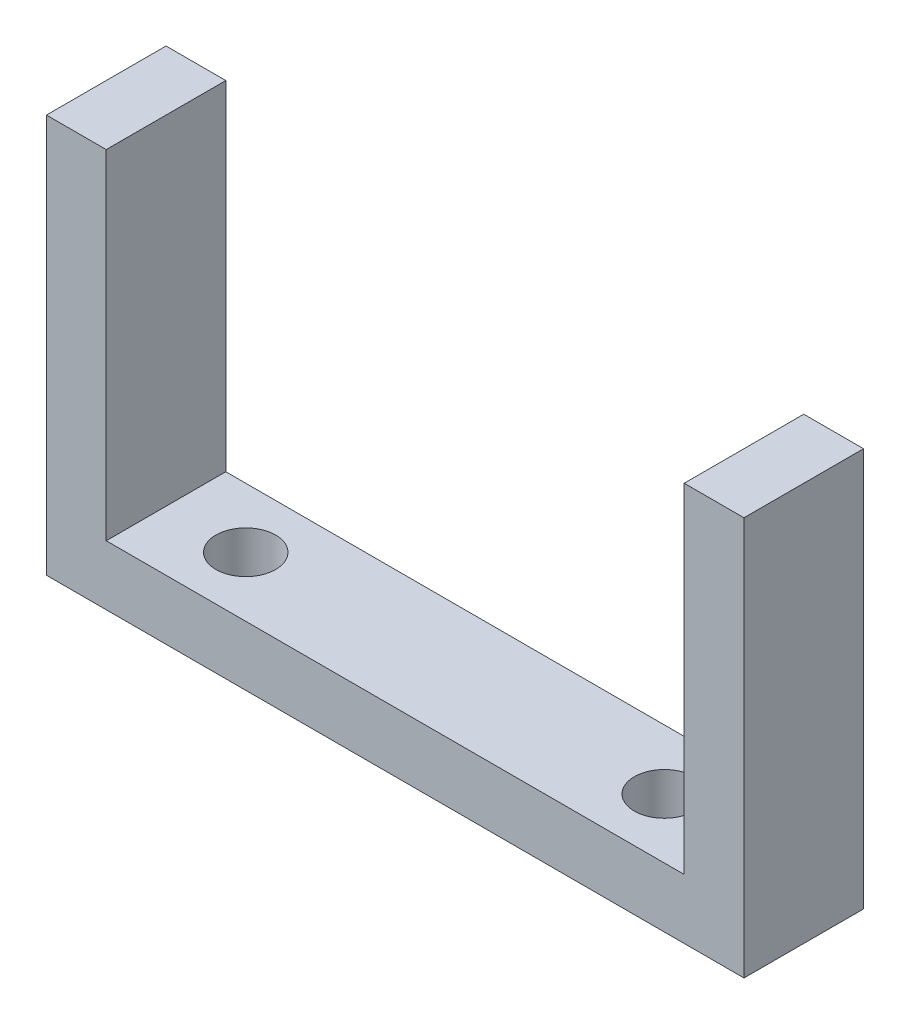
ISO-10303-21;
HEADER;
FILE_DESCRIPTION(('STEP AP214'),'2;1');
FILE_NAME('part.step','',(''),(''),'','','');
FILE_SCHEMA(('AUTOMOTIVE_DESIGN { 1 0 10303 214 1 1 1 1 }'));
ENDSEC;
DATA;
#1=APPLICATION_CONTEXT('core data for automotive mechanical design processes');
#2=APPLICATION_PROTOCOL_DEFINITION('international standard','automotive_design',2000,#1);
#3=PRODUCT_CONTEXT('',#1,'mechanical');
#4=PRODUCT('Part','Part','',(#3));
#5=PRODUCT_RELATED_PRODUCT_CATEGORY('part','',(#4));
#6=PRODUCT_DEFINITION_FORMATION('','',#4);
#7=PRODUCT_DEFINITION_CONTEXT('part definition',#1,'design');
#8=PRODUCT_DEFINITION('design','',#6,#7);
#9=PRODUCT_DEFINITION_SHAPE('','',#8);
#10=(LENGTH_UNIT() NAMED_UNIT(*) SI_UNIT(.MILLI.,.METRE.));
#11=(NAMED_UNIT(*) PLANE_ANGLE_UNIT() SI_UNIT($,.RADIAN.));
#12=(NAMED_UNIT(*) SI_UNIT($,.STERADIAN.) SOLID_ANGLE_UNIT());
#13=UNCERTAINTY_MEASURE_WITH_UNIT(LENGTH_MEASURE(1.E-05),#10,'distance_accuracy_value','');
#14=(GEOMETRIC_REPRESENTATION_CONTEXT(3) GLOBAL_UNCERTAINTY_ASSIGNED_CONTEXT((#13)) GLOBAL_UNIT_ASSIGNED_CONTEXT((#10,
#11,#12)) REPRESENTATION_CONTEXT('',''));
#15=CARTESIAN_POINT('',(0.,0.,0.));
#16=DIRECTION('',(0.,0.,1.));
#17=DIRECTION('',(1.,0.,0.));
#18=AXIS2_PLACEMENT_3D('',#15,#16,#17);
#19=CARTESIAN_POINT('',(0.,0.,6.));
#20=DIRECTION('',(-1.,0.,0.));
#21=DIRECTION('',(0.,-1.,0.));
#22=AXIS2_PLACEMENT_3D('',#19,#20,#21);
#23=PLANE('',#22);
#24=DIRECTION('',(0.,1.,0.));
#25=VECTOR('',#24,1.);
#26=CARTESIAN_POINT('',(0.,0.,0.));
#27=LINE('',#26,#25);
#28=CARTESIAN_POINT('',(0.,-20.,0.));
#29=VERTEX_POINT('',#28);
#30=CARTESIAN_POINT('',(0.,0.,0.));
#31=VERTEX_POINT('',#30);
#32=EDGE_CURVE('E129',#29,#31,#27,.T.);
#33=ORIENTED_EDGE('',*,*,#32,.T.);
#34=DIRECTION('',(0.,0.,-1.));
#35=VECTOR('',#34,1.);
#36=CARTESIAN_POINT('',(0.,0.,6.));
#37=LINE('',#36,#35);
#38=CARTESIAN_POINT('',(0.,0.,6.));
#39=VERTEX_POINT('',#38);
#40=EDGE_CURVE('E11',#39,#31,#37,.T.);
#41=ORIENTED_EDGE('',*,*,#40,.F.);
#42=DIRECTION('',(0.,1.,0.));
#43=VECTOR('',#42,1.);
#44=CARTESIAN_POINT('',(0.,0.,6.));
#45=LINE('',#44,#43);
#46=CARTESIAN_POINT('',(0.,-20.,6.));
#47=VERTEX_POINT('',#46);
#48=EDGE_CURVE('E144',#47,#39,#45,.T.);
#49=ORIENTED_EDGE('',*,*,#48,.F.);
#50=DIRECTION('',(0.,0.,-1.));
#51=VECTOR('',#50,1.);
#52=CARTESIAN_POINT('',(0.,-20.,6.));
#53=LINE('',#52,#51);
#54=EDGE_CURVE('E125',#47,#29,#53,.T.);
#55=ORIENTED_EDGE('',*,*,#54,.T.);
#56=EDGE_LOOP('',(#33,#41,#49,#55));
#57=FACE_BOUND('',#56,.T.);
#58=ADVANCED_FACE('F33',(#57),#23,.F.);
#59=CARTESIAN_POINT('',(0.,0.,6.));
#60=DIRECTION('',(0.,-1.,0.));
#61=DIRECTION('',(0.,0.,-1.));
#62=AXIS2_PLACEMENT_3D('',#59,#60,#61);
#63=PLANE('',#62);
#64=DIRECTION('',(-1.,0.,0.));
#65=VECTOR('',#64,1.);
#66=CARTESIAN_POINT('',(0.,0.,0.));
#67=LINE('',#66,#65);
#68=CARTESIAN_POINT('',(-3.,0.,0.));
#69=VERTEX_POINT('',#68);
#70=EDGE_CURVE('E132',#31,#69,#67,.T.);
#71=ORIENTED_EDGE('',*,*,#70,.T.);
#72=DIRECTION('',(0.,0.,-1.));
#73=VECTOR('',#72,1.);
#74=CARTESIAN_POINT('',(-3.,0.,6.));
#75=LINE('',#74,#73);
#76=CARTESIAN_POINT('',(-3.,0.,6.));
#77=VERTEX_POINT('',#76);
#78=EDGE_CURVE('E41',#77,#69,#75,.T.);
#79=ORIENTED_EDGE('',*,*,#78,.F.);
#80=DIRECTION('',(-1.,0.,0.));
#81=VECTOR('',#80,1.);
#82=CARTESIAN_POINT('',(0.,0.,6.));
#83=LINE('',#82,#81);
#84=EDGE_CURVE('E92',#39,#77,#83,.T.);
#85=ORIENTED_EDGE('',*,*,#84,.F.);
#86=ORIENTED_EDGE('',*,*,#40,.T.);
#87=EDGE_LOOP('',(#71,#79,#85,#86));
#88=FACE_BOUND('',#87,.T.);
#89=ADVANCED_FACE('F214',(#88),#63,.F.);
#90=CARTESIAN_POINT('',(-3.,0.,6.));
#91=DIRECTION('',(1.,0.,0.));
#92=DIRECTION('',(0.,1.,0.));
#93=AXIS2_PLACEMENT_3D('',#90,#91,#92);
#94=PLANE('',#93);
#95=DIRECTION('',(0.,-1.,0.));
#96=VECTOR('',#95,1.);
#97=CARTESIAN_POINT('',(-3.,0.,0.));
#98=LINE('',#97,#96);
#99=CARTESIAN_POINT('',(-3.,-17.,0.));
#100=VERTEX_POINT('',#99);
#101=EDGE_CURVE('E135',#69,#100,#98,.T.);
#102=ORIENTED_EDGE('',*,*,#101,.T.);
#103=DIRECTION('',(0.,0.,-1.));
#104=VECTOR('',#103,1.);
#105=CARTESIAN_POINT('',(-3.,-17.,6.));
#106=LINE('',#105,#104);
#107=CARTESIAN_POINT('',(-3.,-17.,6.));
#108=VERTEX_POINT('',#107);
#109=EDGE_CURVE('E151',#108,#100,#106,.T.);
#110=ORIENTED_EDGE('',*,*,#109,.F.);
#111=DIRECTION('',(0.,-1.,0.));
#112=VECTOR('',#111,1.);
#113=CARTESIAN_POINT('',(-3.,0.,6.));
#114=LINE('',#113,#112);
#115=EDGE_CURVE('E159',#77,#108,#114,.T.);
#116=ORIENTED_EDGE('',*,*,#115,.F.);
#117=ORIENTED_EDGE('',*,*,#78,.T.);
#118=EDGE_LOOP('',(#102,#110,#116,#117));
#119=FACE_BOUND('',#118,.T.);
#120=ADVANCED_FACE('F157',(#119),#94,.F.);
#121=CARTESIAN_POINT('',(-3.,-17.,6.));
#122=DIRECTION('',(0.,-1.,0.));
#123=DIRECTION('',(1.,0.,0.));
#124=AXIS2_PLACEMENT_3D('',#121,#122,#123);
#125=PLANE('',#124);
#126=CARTESIAN_POINT('',(-28.,-17.,3.));
#127=DIRECTION('',(0.,-1.,0.));
#128=DIRECTION('',(0.,0.,-1.));
#129=AXIS2_PLACEMENT_3D('',#126,#127,#128);
#130=CIRCLE('',#129,1.5);
#131=CARTESIAN_POINT('',(-28.,-17.,1.5));
#132=VERTEX_POINT('',#131);
#133=EDGE_CURVE('E133',#132,#132,#130,.T.);
#134=ORIENTED_EDGE('',*,*,#133,.T.);
#135=EDGE_LOOP('',(#134));
#136=FACE_BOUND('',#135,.T.);
#137=CARTESIAN_POINT('',(-7.,-17.,3.));
#138=DIRECTION('',(0.,-1.,0.));
#139=DIRECTION('',(0.,0.,-1.));
#140=AXIS2_PLACEMENT_3D('',#137,#138,#139);
#141=CIRCLE('',#140,1.5);
#142=CARTESIAN_POINT('',(-7.,-17.,1.5));
#143=VERTEX_POINT('',#142);
#144=EDGE_CURVE('E180',#143,#143,#141,.T.);
#145=ORIENTED_EDGE('',*,*,#144,.T.);
#146=EDGE_LOOP('',(#145));
#147=FACE_BOUND('',#146,.T.);
#148=DIRECTION('',(-1.,0.,0.));
#149=VECTOR('',#148,1.);
#150=CARTESIAN_POINT('',(-3.,-17.,0.));
#151=LINE('',#150,#149);
#152=CARTESIAN_POINT('',(-32.,-17.,0.));
#153=VERTEX_POINT('',#152);
#154=EDGE_CURVE('E137',#100,#153,#151,.T.);
#155=ORIENTED_EDGE('',*,*,#154,.T.);
#156=DIRECTION('',(0.,0.,-1.));
#157=VECTOR('',#156,1.);
#158=CARTESIAN_POINT('',(-32.,-17.,6.));
#159=LINE('',#158,#157);
#160=CARTESIAN_POINT('',(-32.,-17.,6.));
#161=VERTEX_POINT('',#160);
#162=EDGE_CURVE('E148',#161,#153,#159,.T.);
#163=ORIENTED_EDGE('',*,*,#162,.F.);
#164=DIRECTION('',(-1.,0.,0.));
#165=VECTOR('',#164,1.);
#166=CARTESIAN_POINT('',(-3.,-17.,6.));
#167=LINE('',#166,#165);
#168=EDGE_CURVE('E171',#108,#161,#167,.T.);
#169=ORIENTED_EDGE('',*,*,#168,.F.);
#170=ORIENTED_EDGE('',*,*,#109,.T.);
#171=EDGE_LOOP('',(#155,#163,#169,#170));
#172=FACE_BOUND('',#171,.T.);
#173=ADVANCED_FACE('F167',(#136,#147,#172),#125,.F.);
#174=CARTESIAN_POINT('',(-32.,0.,6.));
#175=DIRECTION('',(-1.,0.,0.));
#176=DIRECTION('',(0.,0.,1.));
#177=AXIS2_PLACEMENT_3D('',#174,#175,#176);
#178=PLANE('',#177);
#179=DIRECTION('',(0.,1.,0.));
#180=VECTOR('',#179,1.);
#181=CARTESIAN_POINT('',(-32.,0.,0.));
#182=LINE('',#181,#180);
#183=CARTESIAN_POINT('',(-32.,0.,0.));
#184=VERTEX_POINT('',#183);
#185=EDGE_CURVE('E139',#153,#184,#182,.T.);
#186=ORIENTED_EDGE('',*,*,#185,.T.);
#187=DIRECTION('',(0.,0.,-1.));
#188=VECTOR('',#187,1.);
#189=CARTESIAN_POINT('',(-32.,0.,6.));
#190=LINE('',#189,#188);
#191=CARTESIAN_POINT('',(-32.,0.,6.));
#192=VERTEX_POINT('',#191);
#193=EDGE_CURVE('E120',#192,#184,#190,.T.);
#194=ORIENTED_EDGE('',*,*,#193,.F.);
#195=DIRECTION('',(0.,1.,0.));
#196=VECTOR('',#195,1.);
#197=CARTESIAN_POINT('',(-32.,0.,6.));
#198=LINE('',#197,#196);
#199=EDGE_CURVE('E111',#161,#192,#198,.T.);
#200=ORIENTED_EDGE('',*,*,#199,.F.);
#201=ORIENTED_EDGE('',*,*,#162,.T.);
#202=EDGE_LOOP('',(#186,#194,#200,#201));
#203=FACE_BOUND('',#202,.T.);
#204=ADVANCED_FACE('F170',(#203),#178,.F.);
#205=CARTESIAN_POINT('',(-32.,0.,6.));
#206=DIRECTION('',(0.,-1.,0.));
#207=DIRECTION('',(1.,0.,0.));
#208=AXIS2_PLACEMENT_3D('',#205,#206,#207);
#209=PLANE('',#208);
#210=DIRECTION('',(-1.,0.,0.));
#211=VECTOR('',#210,1.);
#212=CARTESIAN_POINT('',(-32.,0.,0.));
#213=LINE('',#212,#211);
#214=CARTESIAN_POINT('',(-35.,0.,0.));
#215=VERTEX_POINT('',#214);
#216=EDGE_CURVE('E119',#184,#215,#213,.T.);
#217=ORIENTED_EDGE('',*,*,#216,.T.);
#218=DIRECTION('',(0.,0.,-1.));
#219=VECTOR('',#218,1.);
#220=CARTESIAN_POINT('',(-35.,0.,6.));
#221=LINE('',#220,#219);
#222=CARTESIAN_POINT('',(-35.,0.,6.));
#223=VERTEX_POINT('',#222);
#224=EDGE_CURVE('E116',#223,#215,#221,.T.);
#225=ORIENTED_EDGE('',*,*,#224,.F.);
#226=DIRECTION('',(-1.,0.,0.));
#227=VECTOR('',#226,1.);
#228=CARTESIAN_POINT('',(-32.,0.,6.));
#229=LINE('',#228,#227);
#230=EDGE_CURVE('E105',#192,#223,#229,.T.);
#231=ORIENTED_EDGE('',*,*,#230,.F.);
#232=ORIENTED_EDGE('',*,*,#193,.T.);
#233=EDGE_LOOP('',(#217,#225,#231,#232));
#234=FACE_BOUND('',#233,.T.);
#235=ADVANCED_FACE('F117',(#234),#209,.F.);
#236=CARTESIAN_POINT('',(-35.,0.,6.));
#237=DIRECTION('',(1.,0.,0.));
#238=DIRECTION('',(0.,1.,0.));
#239=AXIS2_PLACEMENT_3D('',#236,#237,#238);
#240=PLANE('',#239);
#241=DIRECTION('',(0.,-1.,0.));
#242=VECTOR('',#241,1.);
#243=CARTESIAN_POINT('',(-35.,0.,0.));
#244=LINE('',#243,#242);
#245=CARTESIAN_POINT('',(-35.,-20.,0.));
#246=VERTEX_POINT('',#245);
#247=EDGE_CURVE('E78',#215,#246,#244,.T.);
#248=ORIENTED_EDGE('',*,*,#247,.T.);
#249=DIRECTION('',(0.,0.,-1.));
#250=VECTOR('',#249,1.);
#251=CARTESIAN_POINT('',(-35.,-20.,6.));
#252=LINE('',#251,#250);
#253=CARTESIAN_POINT('',(-35.,-20.,6.));
#254=VERTEX_POINT('',#253);
#255=EDGE_CURVE('E121',#254,#246,#252,.T.);
#256=ORIENTED_EDGE('',*,*,#255,.F.);
#257=DIRECTION('',(0.,-1.,0.));
#258=VECTOR('',#257,1.);
#259=CARTESIAN_POINT('',(-35.,0.,6.));
#260=LINE('',#259,#258);
#261=EDGE_CURVE('E109',#223,#254,#260,.T.);
#262=ORIENTED_EDGE('',*,*,#261,.F.);
#263=ORIENTED_EDGE('',*,*,#224,.T.);
#264=EDGE_LOOP('',(#248,#256,#262,#263));
#265=FACE_BOUND('',#264,.T.);
#266=ADVANCED_FACE('F123',(#265),#240,.F.);
#267=CARTESIAN_POINT('',(0.,-20.,6.));
#268=DIRECTION('',(0.,1.,0.));
#269=DIRECTION('',(0.,0.,1.));
#270=AXIS2_PLACEMENT_3D('',#267,#268,#269);
#271=PLANE('',#270);
#272=CARTESIAN_POINT('',(-28.,-20.,3.));
#273=DIRECTION('',(0.,-1.,0.));
#274=DIRECTION('',(0.,0.,-1.));
#275=AXIS2_PLACEMENT_3D('',#272,#273,#274);
#276=CIRCLE('',#275,1.5);
#277=CARTESIAN_POINT('',(-28.,-20.,1.5));
#278=VERTEX_POINT('',#277);
#279=EDGE_CURVE('E183',#278,#278,#276,.T.);
#280=ORIENTED_EDGE('',*,*,#279,.F.);
#281=EDGE_LOOP('',(#280));
#282=FACE_BOUND('',#281,.T.);
#283=CARTESIAN_POINT('',(-7.,-20.,3.));
#284=DIRECTION('',(0.,-1.,0.));
#285=DIRECTION('',(0.,0.,-1.));
#286=AXIS2_PLACEMENT_3D('',#283,#284,#285);
#287=CIRCLE('',#286,1.5);
#288=CARTESIAN_POINT('',(-7.,-20.,1.5));
#289=VERTEX_POINT('',#288);
#290=EDGE_CURVE('E177',#289,#289,#287,.T.);
#291=ORIENTED_EDGE('',*,*,#290,.F.);
#292=EDGE_LOOP('',(#291));
#293=FACE_BOUND('',#292,.T.);
#294=DIRECTION('',(1.,0.,0.));
#295=VECTOR('',#294,1.);
#296=CARTESIAN_POINT('',(0.,-20.,0.));
#297=LINE('',#296,#295);
#298=EDGE_CURVE('E84',#246,#29,#297,.T.);
#299=ORIENTED_EDGE('',*,*,#298,.T.);
#300=ORIENTED_EDGE('',*,*,#54,.F.);
#301=DIRECTION('',(1.,0.,0.));
#302=VECTOR('',#301,1.);
#303=CARTESIAN_POINT('',(0.,-20.,6.));
#304=LINE('',#303,#302);
#305=EDGE_CURVE('E49',#254,#47,#304,.T.);
#306=ORIENTED_EDGE('',*,*,#305,.F.);
#307=ORIENTED_EDGE('',*,*,#255,.T.);
#308=EDGE_LOOP('',(#299,#300,#306,#307));
#309=FACE_BOUND('',#308,.T.);
#310=ADVANCED_FACE('F198',(#282,#293,#309),#271,.F.);
#311=CARTESIAN_POINT('',(0.,0.,6.));
#312=DIRECTION('',(0.,0.,-1.));
#313=DIRECTION('',(-1.,0.,0.));
#314=AXIS2_PLACEMENT_3D('',#311,#312,#313);
#315=PLANE('',#314);
#316=ORIENTED_EDGE('',*,*,#48,.T.);
#317=ORIENTED_EDGE('',*,*,#84,.T.);
#318=ORIENTED_EDGE('',*,*,#115,.T.);
#319=ORIENTED_EDGE('',*,*,#168,.T.);
#320=ORIENTED_EDGE('',*,*,#199,.T.);
#321=ORIENTED_EDGE('',*,*,#230,.T.);
#322=ORIENTED_EDGE('',*,*,#261,.T.);
#323=ORIENTED_EDGE('',*,*,#305,.T.);
#324=EDGE_LOOP('',(#316,#317,#318,#319,#320,#321,#322,#323));
#325=FACE_BOUND('',#324,.T.);
#326=ADVANCED_FACE('F107',(#325),#315,.F.);
#327=CARTESIAN_POINT('',(0.,0.,0.));
#328=DIRECTION('',(0.,0.,-1.));
#329=DIRECTION('',(-1.,0.,0.));
#330=AXIS2_PLACEMENT_3D('',#327,#328,#329);
#331=PLANE('',#330);
#332=ORIENTED_EDGE('',*,*,#32,.F.);
#333=ORIENTED_EDGE('',*,*,#298,.F.);
#334=ORIENTED_EDGE('',*,*,#247,.F.);
#335=ORIENTED_EDGE('',*,*,#216,.F.);
#336=ORIENTED_EDGE('',*,*,#185,.F.);
#337=ORIENTED_EDGE('',*,*,#154,.F.);
#338=ORIENTED_EDGE('',*,*,#101,.F.);
#339=ORIENTED_EDGE('',*,*,#70,.F.);
#340=EDGE_LOOP('',(#332,#333,#334,#335,#336,#337,#338,#339));
#341=FACE_BOUND('',#340,.T.);
#342=ADVANCED_FACE('F163',(#341),#331,.T.);
#343=CARTESIAN_POINT('',(-7.,-17.,3.));
#344=DIRECTION('',(0.,-1.,0.));
#345=DIRECTION('',(0.,0.,-1.));
#346=AXIS2_PLACEMENT_3D('',#343,#344,#345);
#347=CYLINDRICAL_SURFACE('',#346,1.5);
#348=ORIENTED_EDGE('',*,*,#144,.F.);
#349=EDGE_LOOP('',(#348));
#350=FACE_BOUND('',#349,.T.);
#351=ORIENTED_EDGE('',*,*,#290,.T.);
#352=EDGE_LOOP('',(#351));
#353=FACE_BOUND('',#352,.T.);
#354=ADVANCED_FACE('F194',(#350,#353),#347,.F.);
#355=CARTESIAN_POINT('',(-28.,-17.,3.));
#356=DIRECTION('',(0.,-1.,0.));
#357=DIRECTION('',(0.,0.,-1.));
#358=AXIS2_PLACEMENT_3D('',#355,#356,#357);
#359=CYLINDRICAL_SURFACE('',#358,1.5);
#360=ORIENTED_EDGE('',*,*,#133,.F.);
#361=EDGE_LOOP('',(#360));
#362=FACE_BOUND('',#361,.T.);
#363=ORIENTED_EDGE('',*,*,#279,.T.);
#364=EDGE_LOOP('',(#363));
#365=FACE_BOUND('',#364,.T.);
#366=ADVANCED_FACE('F191',(#362,#365),#359,.F.);
#367=CLOSED_SHELL('',(#58,#89,#120,#173,#204,#235,#266,#310,#326,#342,#354,#366));
#368=MANIFOLD_SOLID_BREP('B2',#367);
#369=ADVANCED_BREP_SHAPE_REPRESENTATION('',(#18,#368),#14);
#370=SHAPE_DEFINITION_REPRESENTATION(#9,#369);
ENDSEC;
END-ISO-10303-21;
